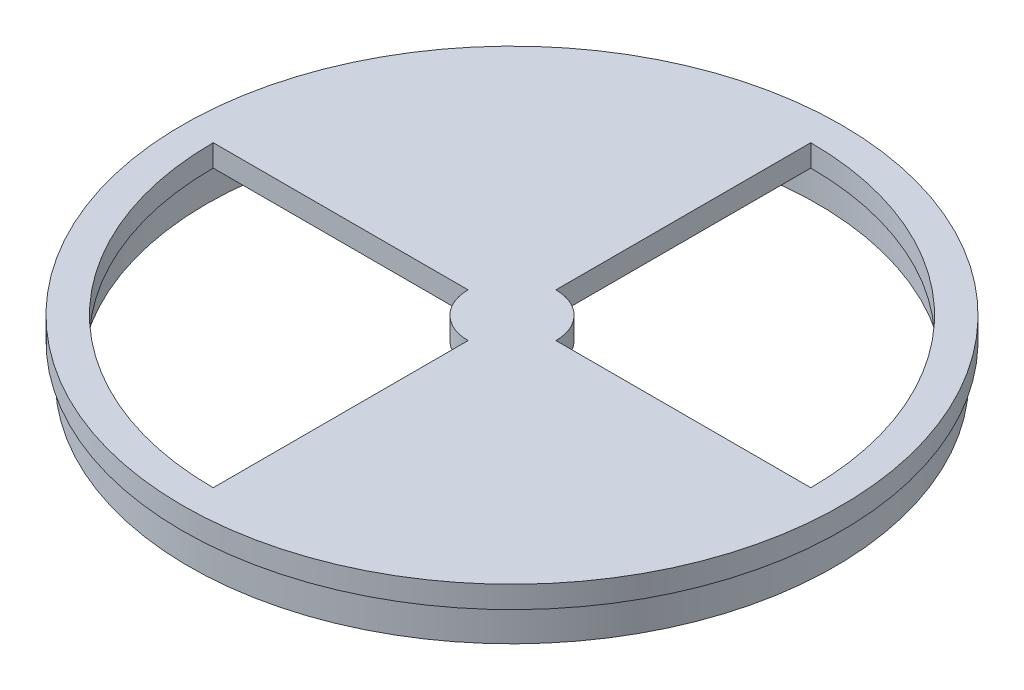
ISO-10303-21;
HEADER;
FILE_DESCRIPTION(('STEP AP214'),'2;1');
FILE_NAME('part.step','',(''),(''),'','','');
FILE_SCHEMA(('AUTOMOTIVE_DESIGN { 1 0 10303 214 1 1 1 1 }'));
ENDSEC;
DATA;
#1=APPLICATION_CONTEXT('core data for automotive mechanical design processes');
#2=APPLICATION_PROTOCOL_DEFINITION('international standard','automotive_design',2000,#1);
#3=PRODUCT_CONTEXT('',#1,'mechanical');
#4=PRODUCT('Part','Part','',(#3));
#5=PRODUCT_RELATED_PRODUCT_CATEGORY('part','',(#4));
#6=PRODUCT_DEFINITION_FORMATION('','',#4);
#7=PRODUCT_DEFINITION_CONTEXT('part definition',#1,'design');
#8=PRODUCT_DEFINITION('design','',#6,#7);
#9=PRODUCT_DEFINITION_SHAPE('','',#8);
#10=(LENGTH_UNIT() NAMED_UNIT(*) SI_UNIT(.MILLI.,.METRE.));
#11=(NAMED_UNIT(*) PLANE_ANGLE_UNIT() SI_UNIT($,.RADIAN.));
#12=(NAMED_UNIT(*) SI_UNIT($,.STERADIAN.) SOLID_ANGLE_UNIT());
#13=UNCERTAINTY_MEASURE_WITH_UNIT(LENGTH_MEASURE(1.E-05),#10,'distance_accuracy_value','');
#14=(GEOMETRIC_REPRESENTATION_CONTEXT(3) GLOBAL_UNCERTAINTY_ASSIGNED_CONTEXT((#13)) GLOBAL_UNIT_ASSIGNED_CONTEXT((#10,
#11,#12)) REPRESENTATION_CONTEXT('',''));
#15=CARTESIAN_POINT('',(0.,0.,0.));
#16=DIRECTION('',(0.,0.,1.));
#17=DIRECTION('',(1.,0.,0.));
#18=AXIS2_PLACEMENT_3D('',#15,#16,#17);
#19=CARTESIAN_POINT('',(48.5413484331681,2.5,-6.62676831259949));
#20=DIRECTION('',(0.,0.,-1.));
#21=DIRECTION('',(-1.,0.,0.));
#22=AXIS2_PLACEMENT_3D('',#19,#20,#21);
#23=PLANE('',#22);
#24=DIRECTION('',(1.,0.,0.));
#25=VECTOR('',#24,1.);
#26=CARTESIAN_POINT('',(48.5413484331681,2.5,-6.62676831259949));
#27=LINE('',#26,#25);
#28=CARTESIAN_POINT('',(18.5413484331681,2.5,-6.62676831259949));
#29=VERTEX_POINT('',#28);
#30=CARTESIAN_POINT('',(47.5413484331681,2.5,-6.62676831259949));
#31=VERTEX_POINT('',#30);
#32=EDGE_CURVE('E143',#29,#31,#27,.T.);
#33=ORIENTED_EDGE('',*,*,#32,.T.);
#34=DIRECTION('',(0.,-1.,0.));
#35=VECTOR('',#34,1.);
#36=CARTESIAN_POINT('',(47.5413484331681,101.494949366117,-6.62676831259949));
#37=LINE('',#36,#35);
#38=CARTESIAN_POINT('',(47.5413484331681,0.,-6.62676831259949));
#39=VERTEX_POINT('',#38);
#40=EDGE_CURVE('E128',#31,#39,#37,.T.);
#41=ORIENTED_EDGE('',*,*,#40,.T.);
#42=DIRECTION('',(1.,0.,0.));
#43=VECTOR('',#42,1.);
#44=CARTESIAN_POINT('',(48.5413484331681,0.,-6.62676831259949));
#45=LINE('',#44,#43);
#46=CARTESIAN_POINT('',(18.5413484331681,0.,-6.62676831259949));
#47=VERTEX_POINT('',#46);
#48=EDGE_CURVE('E134',#47,#39,#45,.T.);
#49=ORIENTED_EDGE('',*,*,#48,.F.);
#50=DIRECTION('',(0.,-1.,0.));
#51=VECTOR('',#50,1.);
#52=CARTESIAN_POINT('',(18.5413484331681,2.5,-6.62676831259949));
#53=LINE('',#52,#51);
#54=EDGE_CURVE('E150',#29,#47,#53,.T.);
#55=ORIENTED_EDGE('',*,*,#54,.F.);
#56=EDGE_LOOP('',(#33,#41,#49,#55));
#57=FACE_BOUND('',#56,.T.);
#58=ADVANCED_FACE('F41',(#57),#23,.T.);
#59=CARTESIAN_POINT('',(13.5413484331681,2.5,-41.6267683125995));
#60=DIRECTION('',(1.,0.,0.));
#61=DIRECTION('',(0.,0.,-1.));
#62=AXIS2_PLACEMENT_3D('',#59,#60,#61);
#63=PLANE('',#62);
#64=DIRECTION('',(0.,0.,1.));
#65=VECTOR('',#64,1.);
#66=CARTESIAN_POINT('',(13.5413484331681,0.,-41.6267683125995));
#67=LINE('',#66,#65);
#68=CARTESIAN_POINT('',(13.5413484331681,0.,-40.6267683125995));
#69=VERTEX_POINT('',#68);
#70=CARTESIAN_POINT('',(13.5413484331681,0.,-11.6267683125995));
#71=VERTEX_POINT('',#70);
#72=EDGE_CURVE('E64',#69,#71,#67,.T.);
#73=ORIENTED_EDGE('',*,*,#72,.F.);
#74=DIRECTION('',(0.,-1.,0.));
#75=VECTOR('',#74,1.);
#76=CARTESIAN_POINT('',(13.5413484331681,101.494949366117,-40.6267683125995));
#77=LINE('',#76,#75);
#78=CARTESIAN_POINT('',(13.5413484331681,2.5,-40.6267683125995));
#79=VERTEX_POINT('',#78);
#80=EDGE_CURVE('E120',#69,#79,#77,.F.);
#81=ORIENTED_EDGE('',*,*,#80,.T.);
#82=DIRECTION('',(0.,0.,1.));
#83=VECTOR('',#82,1.);
#84=CARTESIAN_POINT('',(13.5413484331681,2.5,-41.6267683125995));
#85=LINE('',#84,#83);
#86=CARTESIAN_POINT('',(13.5413484331681,2.5,-11.6267683125995));
#87=VERTEX_POINT('',#86);
#88=EDGE_CURVE('E151',#79,#87,#85,.T.);
#89=ORIENTED_EDGE('',*,*,#88,.T.);
#90=DIRECTION('',(0.,-1.,0.));
#91=VECTOR('',#90,1.);
#92=CARTESIAN_POINT('',(13.5413484331681,2.5,-11.6267683125995));
#93=LINE('',#92,#91);
#94=EDGE_CURVE('E140',#87,#71,#93,.T.);
#95=ORIENTED_EDGE('',*,*,#94,.T.);
#96=EDGE_LOOP('',(#73,#81,#89,#95));
#97=FACE_BOUND('',#96,.T.);
#98=ADVANCED_FACE('F138',(#97),#63,.T.);
#99=CARTESIAN_POINT('',(13.5413484331681,2.5,-1.62676831259949));
#100=DIRECTION('',(-1.,0.,0.));
#101=DIRECTION('',(0.,0.,1.));
#102=AXIS2_PLACEMENT_3D('',#99,#100,#101);
#103=PLANE('',#102);
#104=DIRECTION('',(0.,0.,-1.));
#105=VECTOR('',#104,1.);
#106=CARTESIAN_POINT('',(13.5413484331681,0.,-1.62676831259949));
#107=LINE('',#106,#105);
#108=CARTESIAN_POINT('',(13.5413484331681,0.,27.3732316874005));
#109=VERTEX_POINT('',#108);
#110=CARTESIAN_POINT('',(13.5413484331681,0.,-1.62676831259949));
#111=VERTEX_POINT('',#110);
#112=EDGE_CURVE('E187',#109,#111,#107,.T.);
#113=ORIENTED_EDGE('',*,*,#112,.F.);
#114=DIRECTION('',(0.,-1.,0.));
#115=VECTOR('',#114,1.);
#116=CARTESIAN_POINT('',(13.5413484331681,101.494949366117,27.3732316874005));
#117=LINE('',#116,#115);
#118=CARTESIAN_POINT('',(13.5413484331681,2.5,27.3732316874005));
#119=VERTEX_POINT('',#118);
#120=EDGE_CURVE('E129',#109,#119,#117,.F.);
#121=ORIENTED_EDGE('',*,*,#120,.T.);
#122=DIRECTION('',(0.,0.,-1.));
#123=VECTOR('',#122,1.);
#124=CARTESIAN_POINT('',(13.5413484331681,2.5,-1.62676831259949));
#125=LINE('',#124,#123);
#126=CARTESIAN_POINT('',(13.5413484331681,2.5,-1.62676831259949));
#127=VERTEX_POINT('',#126);
#128=EDGE_CURVE('E188',#119,#127,#125,.T.);
#129=ORIENTED_EDGE('',*,*,#128,.T.);
#130=DIRECTION('',(0.,-1.,0.));
#131=VECTOR('',#130,1.);
#132=CARTESIAN_POINT('',(13.5413484331681,2.5,-1.62676831259949));
#133=LINE('',#132,#131);
#134=EDGE_CURVE('E202',#127,#111,#133,.T.);
#135=ORIENTED_EDGE('',*,*,#134,.T.);
#136=EDGE_LOOP('',(#113,#121,#129,#135));
#137=FACE_BOUND('',#136,.T.);
#138=ADVANCED_FACE('F227',(#137),#103,.T.);
#139=CARTESIAN_POINT('',(8.54134843316813,2.5,-6.62676831259949));
#140=DIRECTION('',(0.,0.,1.));
#141=DIRECTION('',(1.,0.,0.));
#142=AXIS2_PLACEMENT_3D('',#139,#140,#141);
#143=PLANE('',#142);
#144=DIRECTION('',(-1.,0.,0.));
#145=VECTOR('',#144,1.);
#146=CARTESIAN_POINT('',(8.54134843316813,2.5,-6.62676831259949));
#147=LINE('',#146,#145);
#148=CARTESIAN_POINT('',(8.54134843316813,2.5,-6.62676831259949));
#149=VERTEX_POINT('',#148);
#150=CARTESIAN_POINT('',(-20.4586515668319,2.5,-6.62676831259949));
#151=VERTEX_POINT('',#150);
#152=EDGE_CURVE('E193',#149,#151,#147,.T.);
#153=ORIENTED_EDGE('',*,*,#152,.T.);
#154=DIRECTION('',(0.,-1.,0.));
#155=VECTOR('',#154,1.);
#156=CARTESIAN_POINT('',(-20.4586515668319,101.494949366117,-6.62676831259949));
#157=LINE('',#156,#155);
#158=CARTESIAN_POINT('',(-20.4586515668319,0.,-6.62676831259949));
#159=VERTEX_POINT('',#158);
#160=EDGE_CURVE('E219',#151,#159,#157,.T.);
#161=ORIENTED_EDGE('',*,*,#160,.T.);
#162=DIRECTION('',(-1.,0.,0.));
#163=VECTOR('',#162,1.);
#164=CARTESIAN_POINT('',(8.54134843316813,0.,-6.62676831259949));
#165=LINE('',#164,#163);
#166=CARTESIAN_POINT('',(8.54134843316813,0.,-6.62676831259949));
#167=VERTEX_POINT('',#166);
#168=EDGE_CURVE('E191',#167,#159,#165,.T.);
#169=ORIENTED_EDGE('',*,*,#168,.F.);
#170=DIRECTION('',(0.,-1.,0.));
#171=VECTOR('',#170,1.);
#172=CARTESIAN_POINT('',(8.54134843316813,2.5,-6.62676831259949));
#173=LINE('',#172,#171);
#174=EDGE_CURVE('E56',#149,#167,#173,.T.);
#175=ORIENTED_EDGE('',*,*,#174,.F.);
#176=EDGE_LOOP('',(#153,#161,#169,#175));
#177=FACE_BOUND('',#176,.T.);
#178=ADVANCED_FACE('F163',(#177),#143,.T.);
#179=CARTESIAN_POINT('',(13.5413484331681,0.,-6.62676831259949));
#180=DIRECTION('',(0.,1.,0.));
#181=DIRECTION('',(0.,0.,1.));
#182=AXIS2_PLACEMENT_3D('',#179,#180,#181);
#183=PLANE('',#182);
#184=CARTESIAN_POINT('',(13.5413484331681,0.,-6.62676831259949));
#185=DIRECTION('',(0.,1.,0.));
#186=DIRECTION('',(0.,0.,1.));
#187=AXIS2_PLACEMENT_3D('',#184,#185,#186);
#188=CIRCLE('',#187,37.5);
#189=CARTESIAN_POINT('',(13.5413484331681,0.,30.8732316874005));
#190=VERTEX_POINT('',#189);
#191=EDGE_CURVE('E154',#190,#190,#188,.T.);
#192=ORIENTED_EDGE('',*,*,#191,.F.);
#193=EDGE_LOOP('',(#192));
#194=FACE_BOUND('',#193,.T.);
#195=CARTESIAN_POINT('',(13.5413484331681,0.,-6.62676831259949));
#196=DIRECTION('',(0.,1.,0.));
#197=DIRECTION('',(0.,0.,1.));
#198=AXIS2_PLACEMENT_3D('',#195,#196,#197);
#199=CIRCLE('',#198,36.75);
#200=CARTESIAN_POINT('',(-23.2086515668319,0.,-6.62676831259949));
#201=VERTEX_POINT('',#200);
#202=EDGE_CURVE('E11',#201,#201,#199,.F.);
#203=ORIENTED_EDGE('',*,*,#202,.F.);
#204=EDGE_LOOP('',(#203));
#205=FACE_BOUND('',#204,.T.);
#206=ADVANCED_FACE('F160',(#194,#205),#183,.F.);
#207=ORIENTED_EDGE('',*,*,#48,.T.);
#208=CARTESIAN_POINT('',(13.5413484331681,0.,-6.62676831259949));
#209=DIRECTION('',(0.,-1.,0.));
#210=DIRECTION('',(0.,0.,-1.));
#211=AXIS2_PLACEMENT_3D('',#208,#209,#210);
#212=CIRCLE('',#211,34.);
#213=EDGE_CURVE('E122',#69,#39,#212,.T.);
#214=ORIENTED_EDGE('',*,*,#213,.F.);
#215=ORIENTED_EDGE('',*,*,#72,.T.);
#216=CARTESIAN_POINT('',(13.5413484331681,0.,-6.62676831259949));
#217=DIRECTION('',(0.,-1.,0.));
#218=DIRECTION('',(0.,0.,1.));
#219=AXIS2_PLACEMENT_3D('',#216,#217,#218);
#220=CIRCLE('',#219,5.);
#221=EDGE_CURVE('E145',#71,#47,#220,.T.);
#222=ORIENTED_EDGE('',*,*,#221,.T.);
#223=EDGE_LOOP('',(#207,#214,#215,#222));
#224=FACE_BOUND('',#223,.T.);
#225=EDGE_CURVE('E135',#109,#159,#212,.T.);
#226=ORIENTED_EDGE('',*,*,#225,.F.);
#227=ORIENTED_EDGE('',*,*,#112,.T.);
#228=CARTESIAN_POINT('',(13.5413484331681,0.,-6.62676831259949));
#229=DIRECTION('',(0.,-1.,0.));
#230=DIRECTION('',(0.,0.,1.));
#231=AXIS2_PLACEMENT_3D('',#228,#229,#230);
#232=CIRCLE('',#231,5.);
#233=EDGE_CURVE('E196',#111,#167,#232,.T.);
#234=ORIENTED_EDGE('',*,*,#233,.T.);
#235=ORIENTED_EDGE('',*,*,#168,.T.);
#236=EDGE_LOOP('',(#226,#227,#234,#235));
#237=FACE_BOUND('',#236,.T.);
#238=CARTESIAN_POINT('',(13.5413484331681,0.,-6.62676831259949));
#239=DIRECTION('',(0.,1.,0.));
#240=DIRECTION('',(0.,0.,1.));
#241=AXIS2_PLACEMENT_3D('',#238,#239,#240);
#242=CIRCLE('',#241,34.75);
#243=CARTESIAN_POINT('',(-21.2086515668319,0.,-6.62676831259949));
#244=VERTEX_POINT('',#243);
#245=EDGE_CURVE('E182',#244,#244,#242,.T.);
#246=ORIENTED_EDGE('',*,*,#245,.F.);
#247=EDGE_LOOP('',(#246));
#248=FACE_BOUND('',#247,.T.);
#249=ADVANCED_FACE('F132',(#224,#237,#248),#183,.F.);
#250=CARTESIAN_POINT('',(13.5413484331681,2.5,-6.62676831259949));
#251=DIRECTION('',(0.,1.,0.));
#252=DIRECTION('',(0.,0.,1.));
#253=AXIS2_PLACEMENT_3D('',#250,#251,#252);
#254=PLANE('',#253);
#255=ORIENTED_EDGE('',*,*,#88,.F.);
#256=CARTESIAN_POINT('',(13.5413484331681,2.5,-6.62676831259949));
#257=DIRECTION('',(0.,1.,0.));
#258=DIRECTION('',(0.,0.,1.));
#259=AXIS2_PLACEMENT_3D('',#256,#257,#258);
#260=CIRCLE('',#259,34.);
#261=EDGE_CURVE('E125',#79,#31,#260,.F.);
#262=ORIENTED_EDGE('',*,*,#261,.T.);
#263=ORIENTED_EDGE('',*,*,#32,.F.);
#264=CARTESIAN_POINT('',(13.5413484331681,2.5,-6.62676831259949));
#265=DIRECTION('',(0.,-1.,0.));
#266=DIRECTION('',(0.,0.,1.));
#267=AXIS2_PLACEMENT_3D('',#264,#265,#266);
#268=CIRCLE('',#267,5.);
#269=EDGE_CURVE('E141',#87,#29,#268,.T.);
#270=ORIENTED_EDGE('',*,*,#269,.F.);
#271=EDGE_LOOP('',(#255,#262,#263,#270));
#272=FACE_BOUND('',#271,.T.);
#273=ORIENTED_EDGE('',*,*,#128,.F.);
#274=EDGE_CURVE('E216',#119,#151,#260,.F.);
#275=ORIENTED_EDGE('',*,*,#274,.T.);
#276=ORIENTED_EDGE('',*,*,#152,.F.);
#277=CARTESIAN_POINT('',(13.5413484331681,2.5,-6.62676831259949));
#278=DIRECTION('',(0.,-1.,0.));
#279=DIRECTION('',(0.,0.,1.));
#280=AXIS2_PLACEMENT_3D('',#277,#278,#279);
#281=CIRCLE('',#280,5.);
#282=EDGE_CURVE('E190',#127,#149,#281,.T.);
#283=ORIENTED_EDGE('',*,*,#282,.F.);
#284=EDGE_LOOP('',(#273,#275,#276,#283));
#285=FACE_BOUND('',#284,.T.);
#286=CARTESIAN_POINT('',(13.5413484331681,2.5,-6.62676831259949));
#287=DIRECTION('',(0.,1.,0.));
#288=DIRECTION('',(0.,0.,1.));
#289=AXIS2_PLACEMENT_3D('',#286,#287,#288);
#290=CIRCLE('',#289,37.5);
#291=CARTESIAN_POINT('',(13.5413484331681,2.5,30.8732316874005));
#292=VERTEX_POINT('',#291);
#293=EDGE_CURVE('E49',#292,#292,#290,.T.);
#294=ORIENTED_EDGE('',*,*,#293,.T.);
#295=EDGE_LOOP('',(#294));
#296=FACE_BOUND('',#295,.T.);
#297=ADVANCED_FACE('F214',(#272,#285,#296),#254,.T.);
#298=CARTESIAN_POINT('',(13.5413484331681,2.5,-6.62676831259949));
#299=DIRECTION('',(0.,-1.,0.));
#300=DIRECTION('',(0.,0.,-1.));
#301=AXIS2_PLACEMENT_3D('',#298,#299,#300);
#302=CYLINDRICAL_SURFACE('',#301,37.5);
#303=ORIENTED_EDGE('',*,*,#293,.F.);
#304=EDGE_LOOP('',(#303));
#305=FACE_BOUND('',#304,.T.);
#306=ORIENTED_EDGE('',*,*,#191,.T.);
#307=EDGE_LOOP('',(#306));
#308=FACE_BOUND('',#307,.T.);
#309=ADVANCED_FACE('F43',(#305,#308),#302,.T.);
#310=CARTESIAN_POINT('',(13.5413484331681,2.5,-6.62676831259949));
#311=DIRECTION('',(0.,-1.,0.));
#312=DIRECTION('',(0.,0.,-1.));
#313=AXIS2_PLACEMENT_3D('',#310,#311,#312);
#314=CYLINDRICAL_SURFACE('',#313,5.);
#315=ORIENTED_EDGE('',*,*,#221,.F.);
#316=ORIENTED_EDGE('',*,*,#94,.F.);
#317=ORIENTED_EDGE('',*,*,#269,.T.);
#318=ORIENTED_EDGE('',*,*,#54,.T.);
#319=EDGE_LOOP('',(#315,#316,#317,#318));
#320=FACE_BOUND('',#319,.T.);
#321=ADVANCED_FACE('F208',(#320),#314,.T.);
#322=CARTESIAN_POINT('',(13.5413484331681,2.5,-6.62676831259949));
#323=DIRECTION('',(0.,-1.,0.));
#324=DIRECTION('',(0.,0.,-1.));
#325=AXIS2_PLACEMENT_3D('',#322,#323,#324);
#326=CYLINDRICAL_SURFACE('',#325,5.);
#327=ORIENTED_EDGE('',*,*,#233,.F.);
#328=ORIENTED_EDGE('',*,*,#134,.F.);
#329=ORIENTED_EDGE('',*,*,#282,.T.);
#330=ORIENTED_EDGE('',*,*,#174,.T.);
#331=EDGE_LOOP('',(#327,#328,#329,#330));
#332=FACE_BOUND('',#331,.T.);
#333=ADVANCED_FACE('F236',(#332),#326,.T.);
#334=CARTESIAN_POINT('',(13.5413484331681,0.,-6.62676831259949));
#335=DIRECTION('',(0.,-1.,0.));
#336=DIRECTION('',(0.,0.,-1.));
#337=AXIS2_PLACEMENT_3D('',#334,#335,#336);
#338=CYLINDRICAL_SURFACE('',#337,36.75);
#339=DIRECTION('',(0.,-1.,0.));
#340=VECTOR('',#339,1.);
#341=CARTESIAN_POINT('',(-23.2086515668319,0.0999999999999999,-6.62676831259949));
#342=LINE('',#341,#340);
#343=CARTESIAN_POINT('',(-23.2086515668319,-3.9,-6.62676831259949));
#344=VERTEX_POINT('',#343);
#345=EDGE_CURVE('E168',#201,#344,#342,.T.);
#346=ORIENTED_EDGE('',*,*,#345,.F.);
#347=ORIENTED_EDGE('',*,*,#202,.T.);
#348=ORIENTED_EDGE('',*,*,#345,.T.);
#349=CARTESIAN_POINT('',(13.5413484331681,-3.9,-6.62676831259949));
#350=DIRECTION('',(0.,-1.,0.));
#351=DIRECTION('',(-1.,0.,0.));
#352=AXIS2_PLACEMENT_3D('',#349,#350,#351);
#353=CIRCLE('',#352,36.75);
#354=EDGE_CURVE('E170',#344,#344,#353,.T.);
#355=ORIENTED_EDGE('',*,*,#354,.F.);
#356=EDGE_LOOP('',(#346,#347,#348,#355));
#357=FACE_BOUND('',#356,.T.);
#358=ADVANCED_FACE('F166',(#357),#338,.T.);
#359=CARTESIAN_POINT('',(13.5413484331681,0.,-6.62676831259949));
#360=DIRECTION('',(0.,-1.,0.));
#361=DIRECTION('',(0.,0.,-1.));
#362=AXIS2_PLACEMENT_3D('',#359,#360,#361);
#363=CYLINDRICAL_SURFACE('',#362,34.75);
#364=DIRECTION('',(0.,1.,0.));
#365=VECTOR('',#364,1.);
#366=CARTESIAN_POINT('',(-21.2086515668319,0.1,-6.62676831259949));
#367=LINE('',#366,#365);
#368=CARTESIAN_POINT('',(-21.2086515668319,-3.9,-6.62676831259949));
#369=VERTEX_POINT('',#368);
#370=EDGE_CURVE('E174',#369,#244,#367,.T.);
#371=ORIENTED_EDGE('',*,*,#370,.T.);
#372=ORIENTED_EDGE('',*,*,#245,.T.);
#373=ORIENTED_EDGE('',*,*,#370,.F.);
#374=CARTESIAN_POINT('',(13.5413484331681,-3.9,-6.62676831259949));
#375=DIRECTION('',(0.,-1.,0.));
#376=DIRECTION('',(-1.,0.,0.));
#377=AXIS2_PLACEMENT_3D('',#374,#375,#376);
#378=CIRCLE('',#377,34.75);
#379=EDGE_CURVE('E178',#369,#369,#378,.T.);
#380=ORIENTED_EDGE('',*,*,#379,.T.);
#381=EDGE_LOOP('',(#371,#372,#373,#380));
#382=FACE_BOUND('',#381,.T.);
#383=ADVANCED_FACE('F303',(#382),#363,.F.);
#384=CARTESIAN_POINT('',(-23.2086515668319,-3.9,-6.62676831259949));
#385=DIRECTION('',(0.,1.,0.));
#386=DIRECTION('',(0.,0.,1.));
#387=AXIS2_PLACEMENT_3D('',#384,#385,#386);
#388=PLANE('',#387);
#389=ORIENTED_EDGE('',*,*,#354,.T.);
#390=EDGE_LOOP('',(#389));
#391=FACE_BOUND('',#390,.T.);
#392=ORIENTED_EDGE('',*,*,#379,.F.);
#393=EDGE_LOOP('',(#392));
#394=FACE_BOUND('',#393,.T.);
#395=ADVANCED_FACE('F290',(#391,#394),#388,.F.);
#396=CARTESIAN_POINT('',(13.5413484331681,101.494949366117,-6.62676831259949));
#397=DIRECTION('',(0.,-1.,0.));
#398=DIRECTION('',(0.,0.,-1.));
#399=AXIS2_PLACEMENT_3D('',#396,#397,#398);
#400=CYLINDRICAL_SURFACE('',#399,34.);
#401=ORIENTED_EDGE('',*,*,#40,.F.);
#402=ORIENTED_EDGE('',*,*,#261,.F.);
#403=ORIENTED_EDGE('',*,*,#80,.F.);
#404=ORIENTED_EDGE('',*,*,#213,.T.);
#405=EDGE_LOOP('',(#401,#402,#403,#404));
#406=FACE_BOUND('',#405,.T.);
#407=ADVANCED_FACE('F121',(#406),#400,.F.);
#408=ORIENTED_EDGE('',*,*,#120,.F.);
#409=ORIENTED_EDGE('',*,*,#225,.T.);
#410=ORIENTED_EDGE('',*,*,#160,.F.);
#411=ORIENTED_EDGE('',*,*,#274,.F.);
#412=EDGE_LOOP('',(#408,#409,#410,#411));
#413=FACE_BOUND('',#412,.T.);
#414=ADVANCED_FACE('F238',(#413),#400,.F.);
#415=CLOSED_SHELL('',(#58,#98,#138,#178,#206,#249,#297,#309,#321,#333,#358,#383,#395,#407,#414));
#416=MANIFOLD_SOLID_BREP('B2',#415);
#417=ADVANCED_BREP_SHAPE_REPRESENTATION('',(#18,#416),#14);
#418=SHAPE_DEFINITION_REPRESENTATION(#9,#417);
ENDSEC;
END-ISO-10303-21;
